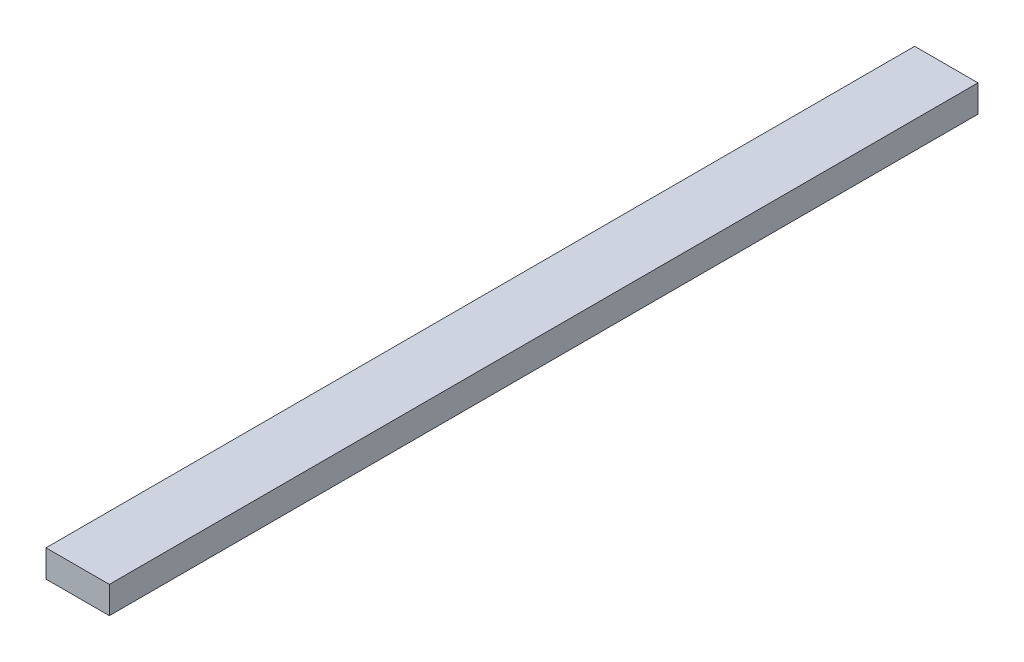
ISO-10303-21;
HEADER;
FILE_DESCRIPTION(('STEP AP214'),'2;1');
FILE_NAME('part.step','',(''),(''),'','','');
FILE_SCHEMA(('AUTOMOTIVE_DESIGN { 1 0 10303 214 1 1 1 1 }'));
ENDSEC;
DATA;
#1=APPLICATION_CONTEXT('core data for automotive mechanical design processes');
#2=APPLICATION_PROTOCOL_DEFINITION('international standard','automotive_design',2000,#1);
#3=PRODUCT_CONTEXT('',#1,'mechanical');
#4=PRODUCT('Part','Part','',(#3));
#5=PRODUCT_RELATED_PRODUCT_CATEGORY('part','',(#4));
#6=PRODUCT_DEFINITION_FORMATION('','',#4);
#7=PRODUCT_DEFINITION_CONTEXT('part definition',#1,'design');
#8=PRODUCT_DEFINITION('design','',#6,#7);
#9=PRODUCT_DEFINITION_SHAPE('','',#8);
#10=(LENGTH_UNIT() NAMED_UNIT(*) SI_UNIT(.MILLI.,.METRE.));
#11=(NAMED_UNIT(*) PLANE_ANGLE_UNIT() SI_UNIT($,.RADIAN.));
#12=(NAMED_UNIT(*) SI_UNIT($,.STERADIAN.) SOLID_ANGLE_UNIT());
#13=UNCERTAINTY_MEASURE_WITH_UNIT(LENGTH_MEASURE(1.E-05),#10,'distance_accuracy_value','');
#14=(GEOMETRIC_REPRESENTATION_CONTEXT(3) GLOBAL_UNCERTAINTY_ASSIGNED_CONTEXT((#13)) GLOBAL_UNIT_ASSIGNED_CONTEXT((#10,
#11,#12)) REPRESENTATION_CONTEXT('',''));
#15=CARTESIAN_POINT('',(0.,0.,0.));
#16=DIRECTION('',(0.,0.,1.));
#17=DIRECTION('',(1.,0.,0.));
#18=AXIS2_PLACEMENT_3D('',#15,#16,#17);
#19=CARTESIAN_POINT('',(-26.1179473106509,29.2993492038892,1219.2));
#20=DIRECTION('',(1.,0.,0.));
#21=DIRECTION('',(0.,1.,0.));
#22=AXIS2_PLACEMENT_3D('',#19,#20,#21);
#23=PLANE('',#22);
#24=DIRECTION('',(0.,-1.,0.));
#25=VECTOR('',#24,1.);
#26=CARTESIAN_POINT('',(-26.1179473106509,29.2993492038892,0.));
#27=LINE('',#26,#25);
#28=CARTESIAN_POINT('',(-26.1179473106509,29.2993492038892,0.));
#29=VERTEX_POINT('',#28);
#30=CARTESIAN_POINT('',(-26.1179473106509,-8.80065079611085,0.));
#31=VERTEX_POINT('',#30);
#32=EDGE_CURVE('E95',#29,#31,#27,.T.);
#33=ORIENTED_EDGE('',*,*,#32,.T.);
#34=DIRECTION('',(0.,0.,-1.));
#35=VECTOR('',#34,1.);
#36=CARTESIAN_POINT('',(-26.1179473106509,-8.80065079611085,1219.2));
#37=LINE('',#36,#35);
#38=CARTESIAN_POINT('',(-26.1179473106509,-8.80065079611085,1219.2));
#39=VERTEX_POINT('',#38);
#40=EDGE_CURVE('E11',#39,#31,#37,.T.);
#41=ORIENTED_EDGE('',*,*,#40,.F.);
#42=DIRECTION('',(0.,-1.,0.));
#43=VECTOR('',#42,1.);
#44=CARTESIAN_POINT('',(-26.1179473106509,29.2993492038892,1219.2));
#45=LINE('',#44,#43);
#46=CARTESIAN_POINT('',(-26.1179473106509,29.2993492038892,1219.2));
#47=VERTEX_POINT('',#46);
#48=EDGE_CURVE('E83',#47,#39,#45,.T.);
#49=ORIENTED_EDGE('',*,*,#48,.F.);
#50=DIRECTION('',(0.,0.,-1.));
#51=VECTOR('',#50,1.);
#52=CARTESIAN_POINT('',(-26.1179473106509,29.2993492038892,1219.2));
#53=LINE('',#52,#51);
#54=EDGE_CURVE('E91',#47,#29,#53,.T.);
#55=ORIENTED_EDGE('',*,*,#54,.T.);
#56=EDGE_LOOP('',(#33,#41,#49,#55));
#57=FACE_BOUND('',#56,.T.);
#58=ADVANCED_FACE('F32',(#57),#23,.F.);
#59=CARTESIAN_POINT('',(-26.1179473106509,-8.80065079611085,1219.2));
#60=DIRECTION('',(0.,1.,0.));
#61=DIRECTION('',(0.,0.,1.));
#62=AXIS2_PLACEMENT_3D('',#59,#60,#61);
#63=PLANE('',#62);
#64=DIRECTION('',(1.,0.,0.));
#65=VECTOR('',#64,1.);
#66=CARTESIAN_POINT('',(-26.1179473106509,-8.80065079611085,0.));
#67=LINE('',#66,#65);
#68=CARTESIAN_POINT('',(62.7820526893491,-8.80065079611085,0.));
#69=VERTEX_POINT('',#68);
#70=EDGE_CURVE('E87',#31,#69,#67,.T.);
#71=ORIENTED_EDGE('',*,*,#70,.T.);
#72=DIRECTION('',(0.,0.,-1.));
#73=VECTOR('',#72,1.);
#74=CARTESIAN_POINT('',(62.7820526893491,-8.80065079611085,1219.2));
#75=LINE('',#74,#73);
#76=CARTESIAN_POINT('',(62.7820526893491,-8.80065079611085,1219.2));
#77=VERTEX_POINT('',#76);
#78=EDGE_CURVE('E40',#77,#69,#75,.T.);
#79=ORIENTED_EDGE('',*,*,#78,.F.);
#80=DIRECTION('',(1.,0.,0.));
#81=VECTOR('',#80,1.);
#82=CARTESIAN_POINT('',(-26.1179473106509,-8.80065079611085,1219.2));
#83=LINE('',#82,#81);
#84=EDGE_CURVE('E78',#39,#77,#83,.T.);
#85=ORIENTED_EDGE('',*,*,#84,.F.);
#86=ORIENTED_EDGE('',*,*,#40,.T.);
#87=EDGE_LOOP('',(#71,#79,#85,#86));
#88=FACE_BOUND('',#87,.T.);
#89=ADVANCED_FACE('F86',(#88),#63,.F.);
#90=CARTESIAN_POINT('',(62.7820526893491,29.2993492038892,1219.2));
#91=DIRECTION('',(-1.,0.,0.));
#92=DIRECTION('',(0.,0.,1.));
#93=AXIS2_PLACEMENT_3D('',#90,#91,#92);
#94=PLANE('',#93);
#95=DIRECTION('',(0.,1.,0.));
#96=VECTOR('',#95,1.);
#97=CARTESIAN_POINT('',(62.7820526893491,29.2993492038892,0.));
#98=LINE('',#97,#96);
#99=CARTESIAN_POINT('',(62.7820526893491,29.2993492038892,0.));
#100=VERTEX_POINT('',#99);
#101=EDGE_CURVE('E65',#69,#100,#98,.T.);
#102=ORIENTED_EDGE('',*,*,#101,.T.);
#103=DIRECTION('',(0.,0.,-1.));
#104=VECTOR('',#103,1.);
#105=CARTESIAN_POINT('',(62.7820526893491,29.2993492038892,1219.2));
#106=LINE('',#105,#104);
#107=CARTESIAN_POINT('',(62.7820526893491,29.2993492038892,1219.2));
#108=VERTEX_POINT('',#107);
#109=EDGE_CURVE('E88',#108,#100,#106,.T.);
#110=ORIENTED_EDGE('',*,*,#109,.F.);
#111=DIRECTION('',(0.,1.,0.));
#112=VECTOR('',#111,1.);
#113=CARTESIAN_POINT('',(62.7820526893491,29.2993492038892,1219.2));
#114=LINE('',#113,#112);
#115=EDGE_CURVE('E81',#77,#108,#114,.T.);
#116=ORIENTED_EDGE('',*,*,#115,.F.);
#117=ORIENTED_EDGE('',*,*,#78,.T.);
#118=EDGE_LOOP('',(#102,#110,#116,#117));
#119=FACE_BOUND('',#118,.T.);
#120=ADVANCED_FACE('F89',(#119),#94,.F.);
#121=CARTESIAN_POINT('',(-26.1179473106509,29.2993492038892,1219.2));
#122=DIRECTION('',(0.,-1.,0.));
#123=DIRECTION('',(0.,0.,-1.));
#124=AXIS2_PLACEMENT_3D('',#121,#122,#123);
#125=PLANE('',#124);
#126=DIRECTION('',(-1.,0.,0.));
#127=VECTOR('',#126,1.);
#128=CARTESIAN_POINT('',(-26.1179473106509,29.2993492038892,0.));
#129=LINE('',#128,#127);
#130=EDGE_CURVE('E71',#100,#29,#129,.T.);
#131=ORIENTED_EDGE('',*,*,#130,.T.);
#132=ORIENTED_EDGE('',*,*,#54,.F.);
#133=DIRECTION('',(-1.,0.,0.));
#134=VECTOR('',#133,1.);
#135=CARTESIAN_POINT('',(-26.1179473106509,29.2993492038892,1219.2));
#136=LINE('',#135,#134);
#137=EDGE_CURVE('E48',#108,#47,#136,.T.);
#138=ORIENTED_EDGE('',*,*,#137,.F.);
#139=ORIENTED_EDGE('',*,*,#109,.T.);
#140=EDGE_LOOP('',(#131,#132,#138,#139));
#141=FACE_BOUND('',#140,.T.);
#142=ADVANCED_FACE('F102',(#141),#125,.F.);
#143=CARTESIAN_POINT('',(0.,0.,1219.2));
#144=DIRECTION('',(0.,0.,1.));
#145=DIRECTION('',(1.,0.,0.));
#146=AXIS2_PLACEMENT_3D('',#143,#144,#145);
#147=PLANE('',#146);
#148=ORIENTED_EDGE('',*,*,#48,.T.);
#149=ORIENTED_EDGE('',*,*,#84,.T.);
#150=ORIENTED_EDGE('',*,*,#115,.T.);
#151=ORIENTED_EDGE('',*,*,#137,.T.);
#152=EDGE_LOOP('',(#148,#149,#150,#151));
#153=FACE_BOUND('',#152,.T.);
#154=ADVANCED_FACE('F79',(#153),#147,.T.);
#155=CARTESIAN_POINT('',(0.,0.,0.));
#156=DIRECTION('',(0.,0.,1.));
#157=DIRECTION('',(1.,0.,0.));
#158=AXIS2_PLACEMENT_3D('',#155,#156,#157);
#159=PLANE('',#158);
#160=ORIENTED_EDGE('',*,*,#32,.F.);
#161=ORIENTED_EDGE('',*,*,#130,.F.);
#162=ORIENTED_EDGE('',*,*,#101,.F.);
#163=ORIENTED_EDGE('',*,*,#70,.F.);
#164=EDGE_LOOP('',(#160,#161,#162,#163));
#165=FACE_BOUND('',#164,.T.);
#166=ADVANCED_FACE('F105',(#165),#159,.F.);
#167=CLOSED_SHELL('',(#58,#89,#120,#142,#154,#166));
#168=MANIFOLD_SOLID_BREP('B2',#167);
#169=ADVANCED_BREP_SHAPE_REPRESENTATION('',(#18,#168),#14);
#170=SHAPE_DEFINITION_REPRESENTATION(#9,#169);
ENDSEC;
END-ISO-10303-21;
